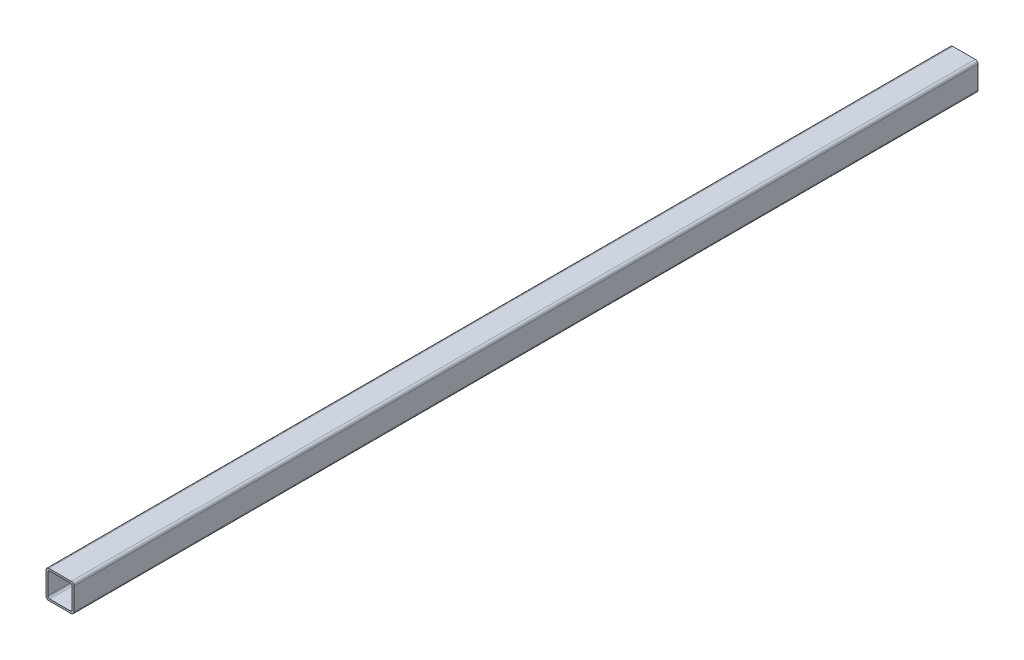
ISO-10303-21;
HEADER;
FILE_DESCRIPTION(('STEP AP214'),'2;1');
FILE_NAME('part.step','',(''),(''),'','','');
FILE_SCHEMA(('AUTOMOTIVE_DESIGN { 1 0 10303 214 1 1 1 1 }'));
ENDSEC;
DATA;
#1=APPLICATION_CONTEXT('core data for automotive mechanical design processes');
#2=APPLICATION_PROTOCOL_DEFINITION('international standard','automotive_design',2000,#1);
#3=PRODUCT_CONTEXT('',#1,'mechanical');
#4=PRODUCT('Part','Part','',(#3));
#5=PRODUCT_RELATED_PRODUCT_CATEGORY('part','',(#4));
#6=PRODUCT_DEFINITION_FORMATION('','',#4);
#7=PRODUCT_DEFINITION_CONTEXT('part definition',#1,'design');
#8=PRODUCT_DEFINITION('design','',#6,#7);
#9=PRODUCT_DEFINITION_SHAPE('','',#8);
#10=(LENGTH_UNIT() NAMED_UNIT(*) SI_UNIT(.MILLI.,.METRE.));
#11=(NAMED_UNIT(*) PLANE_ANGLE_UNIT() SI_UNIT($,.RADIAN.));
#12=(NAMED_UNIT(*) SI_UNIT($,.STERADIAN.) SOLID_ANGLE_UNIT());
#13=UNCERTAINTY_MEASURE_WITH_UNIT(LENGTH_MEASURE(1.E-05),#10,'distance_accuracy_value','');
#14=(GEOMETRIC_REPRESENTATION_CONTEXT(3) GLOBAL_UNCERTAINTY_ASSIGNED_CONTEXT((#13)) GLOBAL_UNIT_ASSIGNED_CONTEXT((#10,
#11,#12)) REPRESENTATION_CONTEXT('',''));
#15=CARTESIAN_POINT('',(0.,0.,0.));
#16=DIRECTION('',(0.,0.,1.));
#17=DIRECTION('',(1.,0.,0.));
#18=AXIS2_PLACEMENT_3D('',#15,#16,#17);
#19=CARTESIAN_POINT('',(-15.,12.,527.026406871193));
#20=DIRECTION('',(1.,0.,0.));
#21=DIRECTION('',(0.,0.,-1.));
#22=AXIS2_PLACEMENT_3D('',#19,#20,#21);
#23=PLANE('',#22);
#24=DIRECTION('',(0.,-1.,0.));
#25=VECTOR('',#24,1.);
#26=CARTESIAN_POINT('',(-15.,12.,484.6));
#27=LINE('',#26,#25);
#28=CARTESIAN_POINT('',(-15.,12.,484.6));
#29=VERTEX_POINT('',#28);
#30=CARTESIAN_POINT('',(-15.,-12.,484.6));
#31=VERTEX_POINT('',#30);
#32=EDGE_CURVE('E197',#29,#31,#27,.T.);
#33=ORIENTED_EDGE('',*,*,#32,.F.);
#34=DIRECTION('',(0.,0.,-1.));
#35=VECTOR('',#34,1.);
#36=CARTESIAN_POINT('',(-15.,12.,527.026406871193));
#37=LINE('',#36,#35);
#38=CARTESIAN_POINT('',(-15.,12.,-484.6));
#39=VERTEX_POINT('',#38);
#40=EDGE_CURVE('E50',#29,#39,#37,.T.);
#41=ORIENTED_EDGE('',*,*,#40,.T.);
#42=DIRECTION('',(0.,-1.,0.));
#43=VECTOR('',#42,1.);
#44=CARTESIAN_POINT('',(-15.,12.,-484.6));
#45=LINE('',#44,#43);
#46=CARTESIAN_POINT('',(-15.,-12.,-484.6));
#47=VERTEX_POINT('',#46);
#48=EDGE_CURVE('E273',#39,#47,#45,.T.);
#49=ORIENTED_EDGE('',*,*,#48,.T.);
#50=DIRECTION('',(0.,0.,-1.));
#51=VECTOR('',#50,1.);
#52=CARTESIAN_POINT('',(-15.,-12.,527.026406871193));
#53=LINE('',#52,#51);
#54=EDGE_CURVE('E233',#31,#47,#53,.T.);
#55=ORIENTED_EDGE('',*,*,#54,.F.);
#56=EDGE_LOOP('',(#33,#41,#49,#55));
#57=FACE_BOUND('',#56,.T.);
#58=ADVANCED_FACE('F35',(#57),#23,.F.);
#59=CARTESIAN_POINT('',(-12.,12.,527.026406871193));
#60=DIRECTION('',(0.,0.,-1.));
#61=DIRECTION('',(-1.,0.,0.));
#62=AXIS2_PLACEMENT_3D('',#59,#60,#61);
#63=CYLINDRICAL_SURFACE('',#62,3.);
#64=CARTESIAN_POINT('',(-12.,12.,484.6));
#65=DIRECTION('',(0.,0.,1.));
#66=DIRECTION('',(0.,-1.,0.));
#67=AXIS2_PLACEMENT_3D('',#64,#65,#66);
#68=CIRCLE('',#67,3.);
#69=CARTESIAN_POINT('',(-12.,15.,484.6));
#70=VERTEX_POINT('',#69);
#71=EDGE_CURVE('E200',#70,#29,#68,.T.);
#72=ORIENTED_EDGE('',*,*,#71,.F.);
#73=DIRECTION('',(0.,0.,-1.));
#74=VECTOR('',#73,1.);
#75=CARTESIAN_POINT('',(-12.,15.,527.026406871193));
#76=LINE('',#75,#74);
#77=CARTESIAN_POINT('',(-12.,15.,-484.6));
#78=VERTEX_POINT('',#77);
#79=EDGE_CURVE('E236',#70,#78,#76,.T.);
#80=ORIENTED_EDGE('',*,*,#79,.T.);
#81=CARTESIAN_POINT('',(-12.,12.,-484.6));
#82=DIRECTION('',(0.,0.,1.));
#83=DIRECTION('',(0.,-1.,0.));
#84=AXIS2_PLACEMENT_3D('',#81,#82,#83);
#85=CIRCLE('',#84,3.);
#86=EDGE_CURVE('E271',#78,#39,#85,.T.);
#87=ORIENTED_EDGE('',*,*,#86,.T.);
#88=ORIENTED_EDGE('',*,*,#40,.F.);
#89=EDGE_LOOP('',(#72,#80,#87,#88));
#90=FACE_BOUND('',#89,.T.);
#91=ADVANCED_FACE('F321',(#90),#63,.T.);
#92=CARTESIAN_POINT('',(-12.,15.,527.026406871193));
#93=DIRECTION('',(0.,-1.,0.));
#94=DIRECTION('',(0.,0.,-1.));
#95=AXIS2_PLACEMENT_3D('',#92,#93,#94);
#96=PLANE('',#95);
#97=DIRECTION('',(-1.,0.,0.));
#98=VECTOR('',#97,1.);
#99=CARTESIAN_POINT('',(-12.,15.,484.6));
#100=LINE('',#99,#98);
#101=CARTESIAN_POINT('',(12.,15.,484.6));
#102=VERTEX_POINT('',#101);
#103=EDGE_CURVE('E203',#102,#70,#100,.T.);
#104=ORIENTED_EDGE('',*,*,#103,.F.);
#105=DIRECTION('',(0.,0.,-1.));
#106=VECTOR('',#105,1.);
#107=CARTESIAN_POINT('',(12.,15.,527.026406871193));
#108=LINE('',#107,#106);
#109=CARTESIAN_POINT('',(12.,15.,-484.6));
#110=VERTEX_POINT('',#109);
#111=EDGE_CURVE('E238',#102,#110,#108,.T.);
#112=ORIENTED_EDGE('',*,*,#111,.T.);
#113=DIRECTION('',(-1.,0.,0.));
#114=VECTOR('',#113,1.);
#115=CARTESIAN_POINT('',(-12.,15.,-484.6));
#116=LINE('',#115,#114);
#117=EDGE_CURVE('E268',#110,#78,#116,.T.);
#118=ORIENTED_EDGE('',*,*,#117,.T.);
#119=ORIENTED_EDGE('',*,*,#79,.F.);
#120=EDGE_LOOP('',(#104,#112,#118,#119));
#121=FACE_BOUND('',#120,.T.);
#122=ADVANCED_FACE('F326',(#121),#96,.F.);
#123=CARTESIAN_POINT('',(12.,12.,527.026406871193));
#124=DIRECTION('',(0.,0.,-1.));
#125=DIRECTION('',(-1.,0.,0.));
#126=AXIS2_PLACEMENT_3D('',#123,#124,#125);
#127=CYLINDRICAL_SURFACE('',#126,3.);
#128=CARTESIAN_POINT('',(12.,12.,484.6));
#129=DIRECTION('',(0.,0.,1.));
#130=DIRECTION('',(0.,-1.,0.));
#131=AXIS2_PLACEMENT_3D('',#128,#129,#130);
#132=CIRCLE('',#131,3.);
#133=CARTESIAN_POINT('',(15.,12.,484.6));
#134=VERTEX_POINT('',#133);
#135=EDGE_CURVE('E206',#134,#102,#132,.T.);
#136=ORIENTED_EDGE('',*,*,#135,.F.);
#137=DIRECTION('',(0.,0.,-1.));
#138=VECTOR('',#137,1.);
#139=CARTESIAN_POINT('',(15.,12.,527.026406871193));
#140=LINE('',#139,#138);
#141=CARTESIAN_POINT('',(15.,12.,-484.6));
#142=VERTEX_POINT('',#141);
#143=EDGE_CURVE('E240',#134,#142,#140,.T.);
#144=ORIENTED_EDGE('',*,*,#143,.T.);
#145=CARTESIAN_POINT('',(12.,12.,-484.6));
#146=DIRECTION('',(0.,0.,1.));
#147=DIRECTION('',(0.,-1.,0.));
#148=AXIS2_PLACEMENT_3D('',#145,#146,#147);
#149=CIRCLE('',#148,3.);
#150=EDGE_CURVE('E265',#142,#110,#149,.T.);
#151=ORIENTED_EDGE('',*,*,#150,.T.);
#152=ORIENTED_EDGE('',*,*,#111,.F.);
#153=EDGE_LOOP('',(#136,#144,#151,#152));
#154=FACE_BOUND('',#153,.T.);
#155=ADVANCED_FACE('F331',(#154),#127,.T.);
#156=CARTESIAN_POINT('',(15.,12.,527.026406871193));
#157=DIRECTION('',(-1.,0.,0.));
#158=DIRECTION('',(0.,-1.,0.));
#159=AXIS2_PLACEMENT_3D('',#156,#157,#158);
#160=PLANE('',#159);
#161=DIRECTION('',(0.,1.,0.));
#162=VECTOR('',#161,1.);
#163=CARTESIAN_POINT('',(15.,12.,484.6));
#164=LINE('',#163,#162);
#165=CARTESIAN_POINT('',(15.,-12.,484.6));
#166=VERTEX_POINT('',#165);
#167=EDGE_CURVE('E209',#166,#134,#164,.T.);
#168=ORIENTED_EDGE('',*,*,#167,.F.);
#169=DIRECTION('',(0.,0.,-1.));
#170=VECTOR('',#169,1.);
#171=CARTESIAN_POINT('',(15.,-12.,527.026406871193));
#172=LINE('',#171,#170);
#173=CARTESIAN_POINT('',(15.,-12.,-484.6));
#174=VERTEX_POINT('',#173);
#175=EDGE_CURVE('E242',#166,#174,#172,.T.);
#176=ORIENTED_EDGE('',*,*,#175,.T.);
#177=DIRECTION('',(0.,1.,0.));
#178=VECTOR('',#177,1.);
#179=CARTESIAN_POINT('',(15.,12.,-484.6));
#180=LINE('',#179,#178);
#181=EDGE_CURVE('E260',#174,#142,#180,.T.);
#182=ORIENTED_EDGE('',*,*,#181,.T.);
#183=ORIENTED_EDGE('',*,*,#143,.F.);
#184=EDGE_LOOP('',(#168,#176,#182,#183));
#185=FACE_BOUND('',#184,.T.);
#186=ADVANCED_FACE('F335',(#185),#160,.F.);
#187=CARTESIAN_POINT('',(12.,-12.,527.026406871193));
#188=DIRECTION('',(0.,0.,-1.));
#189=DIRECTION('',(-1.,0.,0.));
#190=AXIS2_PLACEMENT_3D('',#187,#188,#189);
#191=CYLINDRICAL_SURFACE('',#190,3.);
#192=CARTESIAN_POINT('',(12.,-12.,484.6));
#193=DIRECTION('',(0.,0.,1.));
#194=DIRECTION('',(0.,-1.,0.));
#195=AXIS2_PLACEMENT_3D('',#192,#193,#194);
#196=CIRCLE('',#195,3.);
#197=CARTESIAN_POINT('',(12.,-15.,484.6));
#198=VERTEX_POINT('',#197);
#199=EDGE_CURVE('E212',#198,#166,#196,.T.);
#200=ORIENTED_EDGE('',*,*,#199,.F.);
#201=DIRECTION('',(0.,0.,-1.));
#202=VECTOR('',#201,1.);
#203=CARTESIAN_POINT('',(12.,-15.,527.026406871193));
#204=LINE('',#203,#202);
#205=CARTESIAN_POINT('',(12.,-15.,-484.6));
#206=VERTEX_POINT('',#205);
#207=EDGE_CURVE('E244',#198,#206,#204,.T.);
#208=ORIENTED_EDGE('',*,*,#207,.T.);
#209=CARTESIAN_POINT('',(12.,-12.,-484.6));
#210=DIRECTION('',(0.,0.,1.));
#211=DIRECTION('',(0.,-1.,0.));
#212=AXIS2_PLACEMENT_3D('',#209,#210,#211);
#213=CIRCLE('',#212,3.);
#214=EDGE_CURVE('E259',#206,#174,#213,.T.);
#215=ORIENTED_EDGE('',*,*,#214,.T.);
#216=ORIENTED_EDGE('',*,*,#175,.F.);
#217=EDGE_LOOP('',(#200,#208,#215,#216));
#218=FACE_BOUND('',#217,.T.);
#219=ADVANCED_FACE('F339',(#218),#191,.T.);
#220=CARTESIAN_POINT('',(-12.,-15.,527.026406871193));
#221=DIRECTION('',(0.,1.,0.));
#222=DIRECTION('',(-1.,0.,0.));
#223=AXIS2_PLACEMENT_3D('',#220,#221,#222);
#224=PLANE('',#223);
#225=DIRECTION('',(1.,0.,0.));
#226=VECTOR('',#225,1.);
#227=CARTESIAN_POINT('',(-12.,-15.,484.6));
#228=LINE('',#227,#226);
#229=CARTESIAN_POINT('',(-12.,-15.,484.6));
#230=VERTEX_POINT('',#229);
#231=EDGE_CURVE('E215',#230,#198,#228,.T.);
#232=ORIENTED_EDGE('',*,*,#231,.F.);
#233=DIRECTION('',(0.,0.,-1.));
#234=VECTOR('',#233,1.);
#235=CARTESIAN_POINT('',(-12.,-15.,527.026406871193));
#236=LINE('',#235,#234);
#237=CARTESIAN_POINT('',(-12.,-15.,-484.6));
#238=VERTEX_POINT('',#237);
#239=EDGE_CURVE('E43',#230,#238,#236,.T.);
#240=ORIENTED_EDGE('',*,*,#239,.T.);
#241=DIRECTION('',(1.,0.,0.));
#242=VECTOR('',#241,1.);
#243=CARTESIAN_POINT('',(-12.,-15.,-484.6));
#244=LINE('',#243,#242);
#245=EDGE_CURVE('E178',#238,#206,#244,.T.);
#246=ORIENTED_EDGE('',*,*,#245,.T.);
#247=ORIENTED_EDGE('',*,*,#207,.F.);
#248=EDGE_LOOP('',(#232,#240,#246,#247));
#249=FACE_BOUND('',#248,.T.);
#250=ADVANCED_FACE('F248',(#249),#224,.F.);
#251=CARTESIAN_POINT('',(-12.,-12.,527.026406871193));
#252=DIRECTION('',(0.,0.,-1.));
#253=DIRECTION('',(-1.,0.,0.));
#254=AXIS2_PLACEMENT_3D('',#251,#252,#253);
#255=CYLINDRICAL_SURFACE('',#254,3.);
#256=CARTESIAN_POINT('',(-12.,-12.,484.6));
#257=DIRECTION('',(0.,0.,1.));
#258=DIRECTION('',(0.,-1.,0.));
#259=AXIS2_PLACEMENT_3D('',#256,#257,#258);
#260=CIRCLE('',#259,3.);
#261=EDGE_CURVE('E218',#31,#230,#260,.T.);
#262=ORIENTED_EDGE('',*,*,#261,.F.);
#263=ORIENTED_EDGE('',*,*,#54,.T.);
#264=CARTESIAN_POINT('',(-12.,-12.,-484.6));
#265=DIRECTION('',(0.,0.,1.));
#266=DIRECTION('',(0.,-1.,0.));
#267=AXIS2_PLACEMENT_3D('',#264,#265,#266);
#268=CIRCLE('',#267,3.);
#269=EDGE_CURVE('E173',#47,#238,#268,.T.);
#270=ORIENTED_EDGE('',*,*,#269,.T.);
#271=ORIENTED_EDGE('',*,*,#239,.F.);
#272=EDGE_LOOP('',(#262,#263,#270,#271));
#273=FACE_BOUND('',#272,.T.);
#274=ADVANCED_FACE('F37',(#273),#255,.T.);
#275=CARTESIAN_POINT('',(-13.,11.,527.026406871193));
#276=DIRECTION('',(1.,0.,0.));
#277=DIRECTION('',(0.,0.,-1.));
#278=AXIS2_PLACEMENT_3D('',#275,#276,#277);
#279=PLANE('',#278);
#280=DIRECTION('',(0.,0.,-1.));
#281=VECTOR('',#280,1.);
#282=CARTESIAN_POINT('',(-13.,11.,527.026406871193));
#283=LINE('',#282,#281);
#284=CARTESIAN_POINT('',(-13.,11.,484.6));
#285=VERTEX_POINT('',#284);
#286=CARTESIAN_POINT('',(-13.,11.,-484.6));
#287=VERTEX_POINT('',#286);
#288=EDGE_CURVE('E149',#285,#287,#283,.T.);
#289=ORIENTED_EDGE('',*,*,#288,.F.);
#290=DIRECTION('',(0.,-1.,0.));
#291=VECTOR('',#290,1.);
#292=CARTESIAN_POINT('',(-13.,11.,484.6));
#293=LINE('',#292,#291);
#294=CARTESIAN_POINT('',(-13.,-11.,484.6));
#295=VERTEX_POINT('',#294);
#296=EDGE_CURVE('E11',#285,#295,#293,.T.);
#297=ORIENTED_EDGE('',*,*,#296,.T.);
#298=DIRECTION('',(0.,0.,-1.));
#299=VECTOR('',#298,1.);
#300=CARTESIAN_POINT('',(-13.,-11.,527.026406871193));
#301=LINE('',#300,#299);
#302=CARTESIAN_POINT('',(-13.,-11.,-484.6));
#303=VERTEX_POINT('',#302);
#304=EDGE_CURVE('E158',#295,#303,#301,.T.);
#305=ORIENTED_EDGE('',*,*,#304,.T.);
#306=DIRECTION('',(0.,-1.,0.));
#307=VECTOR('',#306,1.);
#308=CARTESIAN_POINT('',(-13.,11.,-484.6));
#309=LINE('',#308,#307);
#310=EDGE_CURVE('E166',#287,#303,#309,.T.);
#311=ORIENTED_EDGE('',*,*,#310,.F.);
#312=EDGE_LOOP('',(#289,#297,#305,#311));
#313=FACE_BOUND('',#312,.T.);
#314=ADVANCED_FACE('F171',(#313),#279,.T.);
#315=CARTESIAN_POINT('',(-11.,11.,527.026406871193));
#316=DIRECTION('',(0.,0.,-1.));
#317=DIRECTION('',(-1.,0.,0.));
#318=AXIS2_PLACEMENT_3D('',#315,#316,#317);
#319=CYLINDRICAL_SURFACE('',#318,2.);
#320=DIRECTION('',(0.,0.,-1.));
#321=VECTOR('',#320,1.);
#322=CARTESIAN_POINT('',(-11.,13.,527.026406871193));
#323=LINE('',#322,#321);
#324=CARTESIAN_POINT('',(-11.,13.,484.6));
#325=VERTEX_POINT('',#324);
#326=CARTESIAN_POINT('',(-11.,13.,-484.6));
#327=VERTEX_POINT('',#326);
#328=EDGE_CURVE('E157',#325,#327,#323,.T.);
#329=ORIENTED_EDGE('',*,*,#328,.F.);
#330=CARTESIAN_POINT('',(-11.,11.,484.6));
#331=DIRECTION('',(0.,0.,1.));
#332=DIRECTION('',(0.,-1.,0.));
#333=AXIS2_PLACEMENT_3D('',#330,#331,#332);
#334=CIRCLE('',#333,2.);
#335=EDGE_CURVE('E154',#325,#285,#334,.T.);
#336=ORIENTED_EDGE('',*,*,#335,.T.);
#337=ORIENTED_EDGE('',*,*,#288,.T.);
#338=CARTESIAN_POINT('',(-11.,11.,-484.6));
#339=DIRECTION('',(0.,0.,1.));
#340=DIRECTION('',(0.,-1.,0.));
#341=AXIS2_PLACEMENT_3D('',#338,#339,#340);
#342=CIRCLE('',#341,2.);
#343=EDGE_CURVE('E153',#327,#287,#342,.T.);
#344=ORIENTED_EDGE('',*,*,#343,.F.);
#345=EDGE_LOOP('',(#329,#336,#337,#344));
#346=FACE_BOUND('',#345,.T.);
#347=ADVANCED_FACE('F152',(#346),#319,.F.);
#348=CARTESIAN_POINT('',(-11.,13.,527.026406871193));
#349=DIRECTION('',(0.,-1.,0.));
#350=DIRECTION('',(0.,0.,-1.));
#351=AXIS2_PLACEMENT_3D('',#348,#349,#350);
#352=PLANE('',#351);
#353=DIRECTION('',(0.,0.,-1.));
#354=VECTOR('',#353,1.);
#355=CARTESIAN_POINT('',(11.,13.,527.026406871193));
#356=LINE('',#355,#354);
#357=CARTESIAN_POINT('',(11.,13.,484.6));
#358=VERTEX_POINT('',#357);
#359=CARTESIAN_POINT('',(11.,13.,-484.6));
#360=VERTEX_POINT('',#359);
#361=EDGE_CURVE('E223',#358,#360,#356,.T.);
#362=ORIENTED_EDGE('',*,*,#361,.F.);
#363=DIRECTION('',(-1.,0.,0.));
#364=VECTOR('',#363,1.);
#365=CARTESIAN_POINT('',(-11.,13.,484.6));
#366=LINE('',#365,#364);
#367=EDGE_CURVE('E175',#358,#325,#366,.T.);
#368=ORIENTED_EDGE('',*,*,#367,.T.);
#369=ORIENTED_EDGE('',*,*,#328,.T.);
#370=DIRECTION('',(-1.,0.,0.));
#371=VECTOR('',#370,1.);
#372=CARTESIAN_POINT('',(-11.,13.,-484.6));
#373=LINE('',#372,#371);
#374=EDGE_CURVE('E169',#360,#327,#373,.T.);
#375=ORIENTED_EDGE('',*,*,#374,.F.);
#376=EDGE_LOOP('',(#362,#368,#369,#375));
#377=FACE_BOUND('',#376,.T.);
#378=ADVANCED_FACE('F294',(#377),#352,.T.);
#379=CARTESIAN_POINT('',(11.,11.,527.026406871193));
#380=DIRECTION('',(0.,0.,-1.));
#381=DIRECTION('',(-1.,0.,0.));
#382=AXIS2_PLACEMENT_3D('',#379,#380,#381);
#383=CYLINDRICAL_SURFACE('',#382,2.);
#384=DIRECTION('',(0.,0.,-1.));
#385=VECTOR('',#384,1.);
#386=CARTESIAN_POINT('',(13.,11.,527.026406871193));
#387=LINE('',#386,#385);
#388=CARTESIAN_POINT('',(13.,11.,484.6));
#389=VERTEX_POINT('',#388);
#390=CARTESIAN_POINT('',(13.,11.,-484.6));
#391=VERTEX_POINT('',#390);
#392=EDGE_CURVE('E225',#389,#391,#387,.T.);
#393=ORIENTED_EDGE('',*,*,#392,.F.);
#394=CARTESIAN_POINT('',(11.,11.,484.6));
#395=DIRECTION('',(0.,0.,1.));
#396=DIRECTION('',(0.,-1.,0.));
#397=AXIS2_PLACEMENT_3D('',#394,#395,#396);
#398=CIRCLE('',#397,2.);
#399=EDGE_CURVE('E184',#389,#358,#398,.T.);
#400=ORIENTED_EDGE('',*,*,#399,.T.);
#401=ORIENTED_EDGE('',*,*,#361,.T.);
#402=CARTESIAN_POINT('',(11.,11.,-484.6));
#403=DIRECTION('',(0.,0.,1.));
#404=DIRECTION('',(0.,-1.,0.));
#405=AXIS2_PLACEMENT_3D('',#402,#403,#404);
#406=CIRCLE('',#405,2.);
#407=EDGE_CURVE('E286',#391,#360,#406,.T.);
#408=ORIENTED_EDGE('',*,*,#407,.F.);
#409=EDGE_LOOP('',(#393,#400,#401,#408));
#410=FACE_BOUND('',#409,.T.);
#411=ADVANCED_FACE('F298',(#410),#383,.F.);
#412=CARTESIAN_POINT('',(13.,11.,527.026406871193));
#413=DIRECTION('',(-1.,0.,0.));
#414=DIRECTION('',(0.,0.,1.));
#415=AXIS2_PLACEMENT_3D('',#412,#413,#414);
#416=PLANE('',#415);
#417=DIRECTION('',(0.,0.,-1.));
#418=VECTOR('',#417,1.);
#419=CARTESIAN_POINT('',(13.,-11.,527.026406871193));
#420=LINE('',#419,#418);
#421=CARTESIAN_POINT('',(13.,-11.,484.6));
#422=VERTEX_POINT('',#421);
#423=CARTESIAN_POINT('',(13.,-11.,-484.6));
#424=VERTEX_POINT('',#423);
#425=EDGE_CURVE('E227',#422,#424,#420,.T.);
#426=ORIENTED_EDGE('',*,*,#425,.F.);
#427=DIRECTION('',(0.,1.,0.));
#428=VECTOR('',#427,1.);
#429=CARTESIAN_POINT('',(13.,11.,484.6));
#430=LINE('',#429,#428);
#431=EDGE_CURVE('E187',#422,#389,#430,.T.);
#432=ORIENTED_EDGE('',*,*,#431,.T.);
#433=ORIENTED_EDGE('',*,*,#392,.T.);
#434=DIRECTION('',(0.,1.,0.));
#435=VECTOR('',#434,1.);
#436=CARTESIAN_POINT('',(13.,11.,-484.6));
#437=LINE('',#436,#435);
#438=EDGE_CURVE('E283',#424,#391,#437,.T.);
#439=ORIENTED_EDGE('',*,*,#438,.F.);
#440=EDGE_LOOP('',(#426,#432,#433,#439));
#441=FACE_BOUND('',#440,.T.);
#442=ADVANCED_FACE('F300',(#441),#416,.T.);
#443=CARTESIAN_POINT('',(11.,-11.,527.026406871193));
#444=DIRECTION('',(0.,0.,-1.));
#445=DIRECTION('',(-1.,0.,0.));
#446=AXIS2_PLACEMENT_3D('',#443,#444,#445);
#447=CYLINDRICAL_SURFACE('',#446,2.);
#448=DIRECTION('',(0.,0.,-1.));
#449=VECTOR('',#448,1.);
#450=CARTESIAN_POINT('',(11.,-13.,527.026406871193));
#451=LINE('',#450,#449);
#452=CARTESIAN_POINT('',(11.,-13.,484.6));
#453=VERTEX_POINT('',#452);
#454=CARTESIAN_POINT('',(11.,-13.,-484.6));
#455=VERTEX_POINT('',#454);
#456=EDGE_CURVE('E229',#453,#455,#451,.T.);
#457=ORIENTED_EDGE('',*,*,#456,.F.);
#458=CARTESIAN_POINT('',(11.,-11.,484.6));
#459=DIRECTION('',(0.,0.,1.));
#460=DIRECTION('',(0.,-1.,0.));
#461=AXIS2_PLACEMENT_3D('',#458,#459,#460);
#462=CIRCLE('',#461,2.);
#463=EDGE_CURVE('E190',#453,#422,#462,.T.);
#464=ORIENTED_EDGE('',*,*,#463,.T.);
#465=ORIENTED_EDGE('',*,*,#425,.T.);
#466=CARTESIAN_POINT('',(11.,-11.,-484.6));
#467=DIRECTION('',(0.,0.,1.));
#468=DIRECTION('',(0.,-1.,0.));
#469=AXIS2_PLACEMENT_3D('',#466,#467,#468);
#470=CIRCLE('',#469,2.);
#471=EDGE_CURVE('E280',#455,#424,#470,.T.);
#472=ORIENTED_EDGE('',*,*,#471,.F.);
#473=EDGE_LOOP('',(#457,#464,#465,#472));
#474=FACE_BOUND('',#473,.T.);
#475=ADVANCED_FACE('F304',(#474),#447,.F.);
#476=CARTESIAN_POINT('',(-11.,-13.,527.026406871193));
#477=DIRECTION('',(0.,1.,0.));
#478=DIRECTION('',(0.,0.,1.));
#479=AXIS2_PLACEMENT_3D('',#476,#477,#478);
#480=PLANE('',#479);
#481=DIRECTION('',(0.,0.,-1.));
#482=VECTOR('',#481,1.);
#483=CARTESIAN_POINT('',(-11.,-13.,527.026406871193));
#484=LINE('',#483,#482);
#485=CARTESIAN_POINT('',(-11.,-13.,484.6));
#486=VERTEX_POINT('',#485);
#487=CARTESIAN_POINT('',(-11.,-13.,-484.6));
#488=VERTEX_POINT('',#487);
#489=EDGE_CURVE('E231',#486,#488,#484,.T.);
#490=ORIENTED_EDGE('',*,*,#489,.F.);
#491=DIRECTION('',(1.,0.,0.));
#492=VECTOR('',#491,1.);
#493=CARTESIAN_POINT('',(-11.,-13.,484.6));
#494=LINE('',#493,#492);
#495=EDGE_CURVE('E193',#486,#453,#494,.T.);
#496=ORIENTED_EDGE('',*,*,#495,.T.);
#497=ORIENTED_EDGE('',*,*,#456,.T.);
#498=DIRECTION('',(1.,0.,0.));
#499=VECTOR('',#498,1.);
#500=CARTESIAN_POINT('',(-11.,-13.,-484.6));
#501=LINE('',#500,#499);
#502=EDGE_CURVE('E277',#488,#455,#501,.T.);
#503=ORIENTED_EDGE('',*,*,#502,.F.);
#504=EDGE_LOOP('',(#490,#496,#497,#503));
#505=FACE_BOUND('',#504,.T.);
#506=ADVANCED_FACE('F308',(#505),#480,.T.);
#507=CARTESIAN_POINT('',(-11.,-11.,527.026406871193));
#508=DIRECTION('',(0.,0.,-1.));
#509=DIRECTION('',(-1.,0.,0.));
#510=AXIS2_PLACEMENT_3D('',#507,#508,#509);
#511=CYLINDRICAL_SURFACE('',#510,2.);
#512=ORIENTED_EDGE('',*,*,#304,.F.);
#513=CARTESIAN_POINT('',(-11.,-11.,484.6));
#514=DIRECTION('',(0.,0.,1.));
#515=DIRECTION('',(0.,-1.,0.));
#516=AXIS2_PLACEMENT_3D('',#513,#514,#515);
#517=CIRCLE('',#516,2.);
#518=EDGE_CURVE('E58',#295,#486,#517,.T.);
#519=ORIENTED_EDGE('',*,*,#518,.T.);
#520=ORIENTED_EDGE('',*,*,#489,.T.);
#521=CARTESIAN_POINT('',(-11.,-11.,-484.6));
#522=DIRECTION('',(0.,0.,1.));
#523=DIRECTION('',(0.,-1.,0.));
#524=AXIS2_PLACEMENT_3D('',#521,#522,#523);
#525=CIRCLE('',#524,2.);
#526=EDGE_CURVE('E275',#303,#488,#525,.T.);
#527=ORIENTED_EDGE('',*,*,#526,.F.);
#528=EDGE_LOOP('',(#512,#519,#520,#527));
#529=FACE_BOUND('',#528,.T.);
#530=ADVANCED_FACE('F310',(#529),#511,.F.);
#531=CARTESIAN_POINT('',(-409.721359549899,17.7500000016889,484.6));
#532=DIRECTION('',(0.,0.,1.));
#533=DIRECTION('',(0.,-1.,0.));
#534=AXIS2_PLACEMENT_3D('',#531,#532,#533);
#535=PLANE('',#534);
#536=ORIENTED_EDGE('',*,*,#518,.F.);
#537=ORIENTED_EDGE('',*,*,#296,.F.);
#538=ORIENTED_EDGE('',*,*,#335,.F.);
#539=ORIENTED_EDGE('',*,*,#367,.F.);
#540=ORIENTED_EDGE('',*,*,#399,.F.);
#541=ORIENTED_EDGE('',*,*,#431,.F.);
#542=ORIENTED_EDGE('',*,*,#463,.F.);
#543=ORIENTED_EDGE('',*,*,#495,.F.);
#544=EDGE_LOOP('',(#536,#537,#538,#539,#540,#541,#542,#543));
#545=FACE_BOUND('',#544,.T.);
#546=ORIENTED_EDGE('',*,*,#32,.T.);
#547=ORIENTED_EDGE('',*,*,#261,.T.);
#548=ORIENTED_EDGE('',*,*,#231,.T.);
#549=ORIENTED_EDGE('',*,*,#199,.T.);
#550=ORIENTED_EDGE('',*,*,#167,.T.);
#551=ORIENTED_EDGE('',*,*,#135,.T.);
#552=ORIENTED_EDGE('',*,*,#103,.T.);
#553=ORIENTED_EDGE('',*,*,#71,.T.);
#554=EDGE_LOOP('',(#546,#547,#548,#549,#550,#551,#552,#553));
#555=FACE_BOUND('',#554,.T.);
#556=ADVANCED_FACE('F295',(#545,#555),#535,.T.);
#557=CARTESIAN_POINT('',(-409.721359549899,17.7500000016889,-484.6));
#558=DIRECTION('',(0.,0.,-1.));
#559=DIRECTION('',(0.,-1.,0.));
#560=AXIS2_PLACEMENT_3D('',#557,#558,#559);
#561=PLANE('',#560);
#562=ORIENTED_EDGE('',*,*,#526,.T.);
#563=ORIENTED_EDGE('',*,*,#502,.T.);
#564=ORIENTED_EDGE('',*,*,#471,.T.);
#565=ORIENTED_EDGE('',*,*,#438,.T.);
#566=ORIENTED_EDGE('',*,*,#407,.T.);
#567=ORIENTED_EDGE('',*,*,#374,.T.);
#568=ORIENTED_EDGE('',*,*,#343,.T.);
#569=ORIENTED_EDGE('',*,*,#310,.T.);
#570=EDGE_LOOP('',(#562,#563,#564,#565,#566,#567,#568,#569));
#571=FACE_BOUND('',#570,.T.);
#572=ORIENTED_EDGE('',*,*,#48,.F.);
#573=ORIENTED_EDGE('',*,*,#86,.F.);
#574=ORIENTED_EDGE('',*,*,#117,.F.);
#575=ORIENTED_EDGE('',*,*,#150,.F.);
#576=ORIENTED_EDGE('',*,*,#181,.F.);
#577=ORIENTED_EDGE('',*,*,#214,.F.);
#578=ORIENTED_EDGE('',*,*,#245,.F.);
#579=ORIENTED_EDGE('',*,*,#269,.F.);
#580=EDGE_LOOP('',(#572,#573,#574,#575,#576,#577,#578,#579));
#581=FACE_BOUND('',#580,.T.);
#582=ADVANCED_FACE('F164',(#571,#581),#561,.T.);
#583=CLOSED_SHELL('',(#58,#91,#122,#155,#186,#219,#250,#274,#314,#347,#378,#411,#442,#475,#506,
#530,#556,#582));
#584=MANIFOLD_SOLID_BREP('B2',#583);
#585=ADVANCED_BREP_SHAPE_REPRESENTATION('',(#18,#584),#14);
#586=SHAPE_DEFINITION_REPRESENTATION(#9,#585);
ENDSEC;
END-ISO-10303-21;
